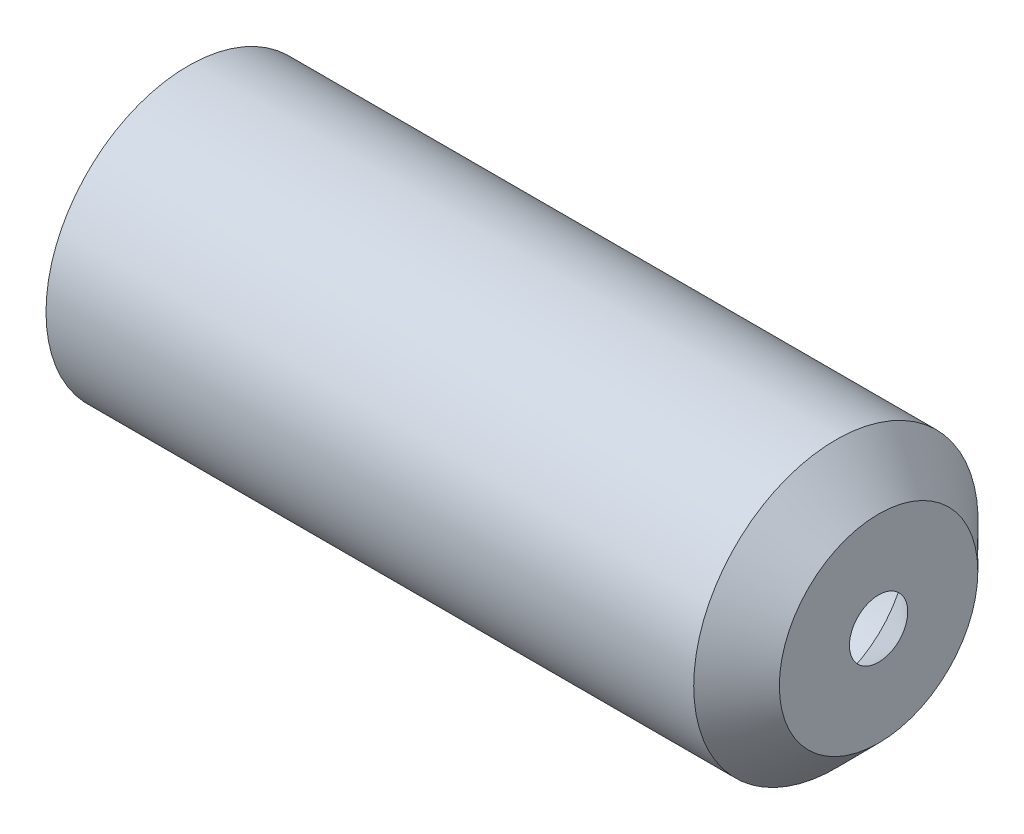
ISO-10303-21;
HEADER;
FILE_DESCRIPTION(('STEP AP214'),'2;1');
FILE_NAME('part.step','',(''),(''),'','','');
FILE_SCHEMA(('AUTOMOTIVE_DESIGN { 1 0 10303 214 1 1 1 1 }'));
ENDSEC;
DATA;
#1=APPLICATION_CONTEXT('core data for automotive mechanical design processes');
#2=APPLICATION_PROTOCOL_DEFINITION('international standard','automotive_design',2000,#1);
#3=PRODUCT_CONTEXT('',#1,'mechanical');
#4=PRODUCT('Part','Part','',(#3));
#5=PRODUCT_RELATED_PRODUCT_CATEGORY('part','',(#4));
#6=PRODUCT_DEFINITION_FORMATION('','',#4);
#7=PRODUCT_DEFINITION_CONTEXT('part definition',#1,'design');
#8=PRODUCT_DEFINITION('design','',#6,#7);
#9=PRODUCT_DEFINITION_SHAPE('','',#8);
#10=(LENGTH_UNIT() NAMED_UNIT(*) SI_UNIT(.MILLI.,.METRE.));
#11=(NAMED_UNIT(*) PLANE_ANGLE_UNIT() SI_UNIT($,.RADIAN.));
#12=(NAMED_UNIT(*) SI_UNIT($,.STERADIAN.) SOLID_ANGLE_UNIT());
#13=UNCERTAINTY_MEASURE_WITH_UNIT(LENGTH_MEASURE(1.E-05),#10,'distance_accuracy_value','');
#14=(GEOMETRIC_REPRESENTATION_CONTEXT(3) GLOBAL_UNCERTAINTY_ASSIGNED_CONTEXT((#13)) GLOBAL_UNIT_ASSIGNED_CONTEXT((#10,
#11,#12)) REPRESENTATION_CONTEXT('',''));
#15=CARTESIAN_POINT('',(0.,0.,0.));
#16=DIRECTION('',(0.,0.,1.));
#17=DIRECTION('',(1.,0.,0.));
#18=AXIS2_PLACEMENT_3D('',#15,#16,#17);
#19=CARTESIAN_POINT('',(-139.6602,28.8,0.));
#20=DIRECTION('',(1.,0.,0.));
#21=DIRECTION('',(0.,0.,-1.));
#22=AXIS2_PLACEMENT_3D('',#19,#20,#21);
#23=PLANE('',#22);
#24=CARTESIAN_POINT('',(-139.6602,0.,0.));
#25=DIRECTION('',(-1.,0.,0.));
#26=DIRECTION('',(0.,0.,1.));
#27=AXIS2_PLACEMENT_3D('',#24,#25,#26);
#28=CIRCLE('',#27,18.8);
#29=CARTESIAN_POINT('',(-139.6602,0.,18.8));
#30=VERTEX_POINT('',#29);
#31=EDGE_CURVE('E10',#30,#30,#28,.T.);
#32=ORIENTED_EDGE('',*,*,#31,.F.);
#33=EDGE_LOOP('',(#32));
#34=FACE_BOUND('',#33,.T.);
#35=CARTESIAN_POINT('',(-139.6602,0.,0.));
#36=DIRECTION('',(-1.,0.,0.));
#37=DIRECTION('',(0.,0.,1.));
#38=AXIS2_PLACEMENT_3D('',#35,#36,#37);
#39=CIRCLE('',#38,28.8);
#40=CARTESIAN_POINT('',(-139.6602,0.,28.8));
#41=VERTEX_POINT('',#40);
#42=EDGE_CURVE('E61',#41,#41,#39,.T.);
#43=ORIENTED_EDGE('',*,*,#42,.T.);
#44=EDGE_LOOP('',(#43));
#45=FACE_BOUND('',#44,.T.);
#46=ADVANCED_FACE('F39',(#34,#45),#23,.F.);
#47=CARTESIAN_POINT('',(-0.2521446048985,0.,0.));
#48=DIRECTION('',(-1.,0.,0.));
#49=DIRECTION('',(0.,0.,1.));
#50=AXIS2_PLACEMENT_3D('',#47,#48,#49);
#51=CYLINDRICAL_SURFACE('',#50,18.8);
#52=CARTESIAN_POINT('',(-12.6602,0.,0.));
#53=DIRECTION('',(-1.,0.,0.));
#54=DIRECTION('',(0.,0.,1.));
#55=AXIS2_PLACEMENT_3D('',#52,#53,#54);
#56=CIRCLE('',#55,18.8);
#57=CARTESIAN_POINT('',(-12.6602,0.,18.8));
#58=VERTEX_POINT('',#57);
#59=EDGE_CURVE('E45',#58,#58,#56,.T.);
#60=ORIENTED_EDGE('',*,*,#59,.F.);
#61=EDGE_LOOP('',(#60));
#62=FACE_BOUND('',#61,.T.);
#63=ORIENTED_EDGE('',*,*,#31,.T.);
#64=EDGE_LOOP('',(#63));
#65=FACE_BOUND('',#64,.T.);
#66=ADVANCED_FACE('F86',(#62,#65),#51,.F.);
#67=CARTESIAN_POINT('',(-12.6602,0.,0.));
#68=DIRECTION('',(-1.,0.,0.));
#69=DIRECTION('',(0.,0.,1.));
#70=AXIS2_PLACEMENT_3D('',#67,#68,#69);
#71=CONICAL_SURFACE('',#70,18.8,0.789289194344093);
#72=CARTESIAN_POINT('',(0.1398,0.,0.));
#73=DIRECTION('',(-1.,0.,0.));
#74=DIRECTION('',(0.,0.,1.));
#75=AXIS2_PLACEMENT_3D('',#72,#73,#74);
#76=CIRCLE('',#75,5.9);
#77=CARTESIAN_POINT('',(0.1398,0.,5.9));
#78=VERTEX_POINT('',#77);
#79=EDGE_CURVE('E49',#78,#78,#76,.T.);
#80=ORIENTED_EDGE('',*,*,#79,.F.);
#81=EDGE_LOOP('',(#80));
#82=FACE_BOUND('',#81,.T.);
#83=ORIENTED_EDGE('',*,*,#59,.T.);
#84=EDGE_LOOP('',(#83));
#85=FACE_BOUND('',#84,.T.);
#86=ADVANCED_FACE('F81',(#82,#85),#71,.F.);
#87=CARTESIAN_POINT('',(0.1398,5.9,0.));
#88=DIRECTION('',(-1.,0.,0.));
#89=DIRECTION('',(0.,0.,1.));
#90=AXIS2_PLACEMENT_3D('',#87,#88,#89);
#91=PLANE('',#90);
#92=CARTESIAN_POINT('',(0.1398,0.,0.));
#93=DIRECTION('',(-1.,0.,0.));
#94=DIRECTION('',(0.,0.,1.));
#95=AXIS2_PLACEMENT_3D('',#92,#93,#94);
#96=CIRCLE('',#95,20.097485816708);
#97=CARTESIAN_POINT('',(0.1398,0.,20.097485816708));
#98=VERTEX_POINT('',#97);
#99=EDGE_CURVE('E53',#98,#98,#96,.T.);
#100=ORIENTED_EDGE('',*,*,#99,.F.);
#101=EDGE_LOOP('',(#100));
#102=FACE_BOUND('',#101,.T.);
#103=ORIENTED_EDGE('',*,*,#79,.T.);
#104=EDGE_LOOP('',(#103));
#105=FACE_BOUND('',#104,.T.);
#106=ADVANCED_FACE('F75',(#102,#105),#91,.F.);
#107=CARTESIAN_POINT('',(0.1398,0.,0.));
#108=DIRECTION('',(-1.,0.,0.));
#109=DIRECTION('',(0.,0.,1.));
#110=AXIS2_PLACEMENT_3D('',#107,#108,#109);
#111=CONICAL_SURFACE('',#110,20.097485816708,0.789289194344093);
#112=CARTESIAN_POINT('',(-8.49525283303392,0.,0.));
#113=DIRECTION('',(-1.,0.,0.));
#114=DIRECTION('',(0.,0.,1.));
#115=AXIS2_PLACEMENT_3D('',#112,#113,#114);
#116=CIRCLE('',#115,28.8);
#117=CARTESIAN_POINT('',(-8.49525283303392,0.,28.8));
#118=VERTEX_POINT('',#117);
#119=EDGE_CURVE('E58',#118,#118,#116,.T.);
#120=ORIENTED_EDGE('',*,*,#119,.F.);
#121=EDGE_LOOP('',(#120));
#122=FACE_BOUND('',#121,.T.);
#123=ORIENTED_EDGE('',*,*,#99,.T.);
#124=EDGE_LOOP('',(#123));
#125=FACE_BOUND('',#124,.T.);
#126=ADVANCED_FACE('F69',(#122,#125),#111,.T.);
#127=CARTESIAN_POINT('',(-0.2521446048985,0.,0.));
#128=DIRECTION('',(-1.,0.,0.));
#129=DIRECTION('',(0.,0.,1.));
#130=AXIS2_PLACEMENT_3D('',#127,#128,#129);
#131=CYLINDRICAL_SURFACE('',#130,28.8);
#132=ORIENTED_EDGE('',*,*,#42,.F.);
#133=EDGE_LOOP('',(#132));
#134=FACE_BOUND('',#133,.T.);
#135=ORIENTED_EDGE('',*,*,#119,.T.);
#136=EDGE_LOOP('',(#135));
#137=FACE_BOUND('',#136,.T.);
#138=ADVANCED_FACE('F66',(#134,#137),#131,.T.);
#139=CLOSED_SHELL('',(#46,#66,#86,#106,#126,#138));
#140=MANIFOLD_SOLID_BREP('B2',#139);
#141=ADVANCED_BREP_SHAPE_REPRESENTATION('',(#18,#140),#14);
#142=SHAPE_DEFINITION_REPRESENTATION(#9,#141);
ENDSEC;
END-ISO-10303-21;
